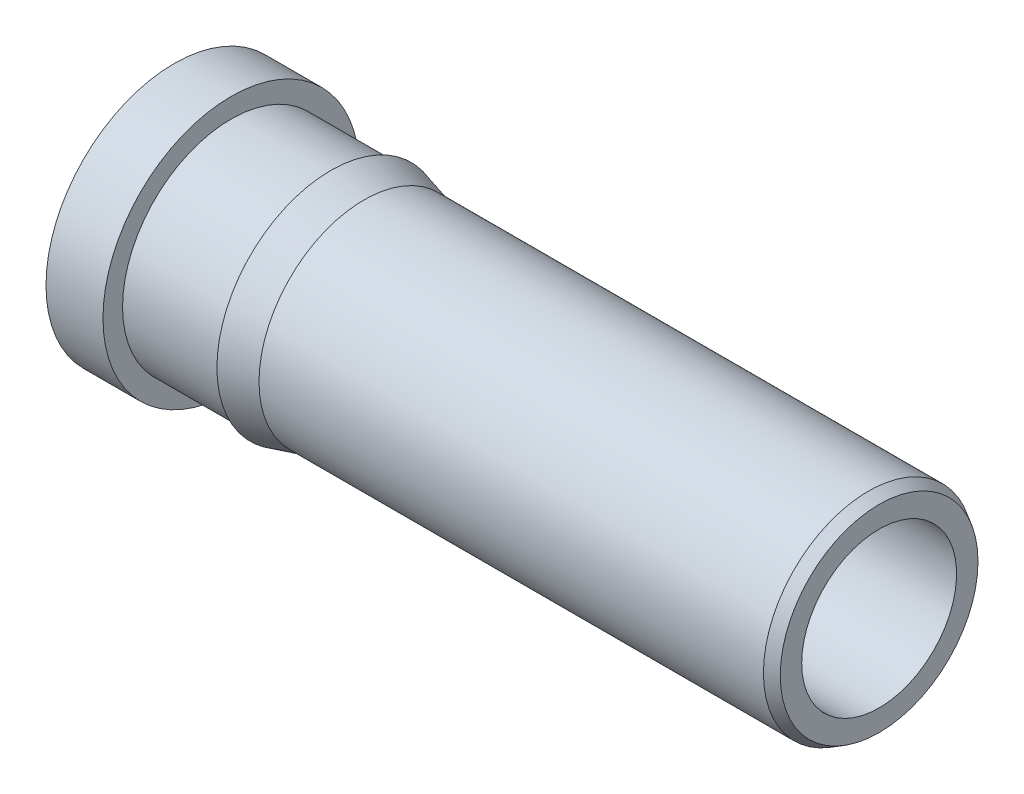
ISO-10303-21;
HEADER;
FILE_DESCRIPTION(('STEP AP214'),'2;1');
FILE_NAME('part.step','',(''),(''),'','','');
FILE_SCHEMA(('AUTOMOTIVE_DESIGN { 1 0 10303 214 1 1 1 1 }'));
ENDSEC;
DATA;
#1=APPLICATION_CONTEXT('core data for automotive mechanical design processes');
#2=APPLICATION_PROTOCOL_DEFINITION('international standard','automotive_design',2000,#1);
#3=PRODUCT_CONTEXT('',#1,'mechanical');
#4=PRODUCT('Part','Part','',(#3));
#5=PRODUCT_RELATED_PRODUCT_CATEGORY('part','',(#4));
#6=PRODUCT_DEFINITION_FORMATION('','',#4);
#7=PRODUCT_DEFINITION_CONTEXT('part definition',#1,'design');
#8=PRODUCT_DEFINITION('design','',#6,#7);
#9=PRODUCT_DEFINITION_SHAPE('','',#8);
#10=(LENGTH_UNIT() NAMED_UNIT(*) SI_UNIT(.MILLI.,.METRE.));
#11=(NAMED_UNIT(*) PLANE_ANGLE_UNIT() SI_UNIT($,.RADIAN.));
#12=(NAMED_UNIT(*) SI_UNIT($,.STERADIAN.) SOLID_ANGLE_UNIT());
#13=UNCERTAINTY_MEASURE_WITH_UNIT(LENGTH_MEASURE(1.E-05),#10,'distance_accuracy_value','');
#14=(GEOMETRIC_REPRESENTATION_CONTEXT(3) GLOBAL_UNCERTAINTY_ASSIGNED_CONTEXT((#13)) GLOBAL_UNIT_ASSIGNED_CONTEXT((#10,
#11,#12)) REPRESENTATION_CONTEXT('',''));
#15=CARTESIAN_POINT('',(0.,0.,0.));
#16=DIRECTION('',(0.,0.,1.));
#17=DIRECTION('',(1.,0.,0.));
#18=AXIS2_PLACEMENT_3D('',#15,#16,#17);
#19=CARTESIAN_POINT('',(5.02920000000003,0.705305909487725,0.));
#20=DIRECTION('',(-1.,0.,0.));
#21=DIRECTION('',(0.,0.,1.));
#22=AXIS2_PLACEMENT_3D('',#19,#20,#21);
#23=PLANE('',#22);
#24=CARTESIAN_POINT('',(5.02920000000004,0.,0.));
#25=DIRECTION('',(-1.,0.,0.));
#26=DIRECTION('',(0.,0.,1.));
#27=AXIS2_PLACEMENT_3D('',#24,#25,#26);
#28=CIRCLE('',#27,0.552449999999999);
#29=CARTESIAN_POINT('',(5.02920000000004,0.,0.552449999999999));
#30=VERTEX_POINT('',#29);
#31=EDGE_CURVE('E70',#30,#30,#28,.T.);
#32=ORIENTED_EDGE('',*,*,#31,.T.);
#33=EDGE_LOOP('',(#32));
#34=FACE_BOUND('',#33,.T.);
#35=CARTESIAN_POINT('',(5.02920000000001,0.,0.));
#36=DIRECTION('',(-1.,0.,0.));
#37=DIRECTION('',(0.,0.,1.));
#38=AXIS2_PLACEMENT_3D('',#35,#36,#37);
#39=CIRCLE('',#38,0.705305909487725);
#40=CARTESIAN_POINT('',(5.02920000000001,0.,0.705305909487725));
#41=VERTEX_POINT('',#40);
#42=EDGE_CURVE('E10',#41,#41,#39,.T.);
#43=ORIENTED_EDGE('',*,*,#42,.F.);
#44=EDGE_LOOP('',(#43));
#45=FACE_BOUND('',#44,.T.);
#46=ADVANCED_FACE('F33',(#34,#45),#23,.F.);
#47=CARTESIAN_POINT('',(5.02920000000001,0.,0.));
#48=DIRECTION('',(-1.,0.,0.));
#49=DIRECTION('',(0.,0.,1.));
#50=AXIS2_PLACEMENT_3D('',#47,#48,#49);
#51=CONICAL_SURFACE('',#50,0.705305909487725,0.523598775598529);
#52=CARTESIAN_POINT('',(4.95300000000004,0.,0.));
#53=DIRECTION('',(-1.,0.,0.));
#54=DIRECTION('',(0.,0.,1.));
#55=AXIS2_PLACEMENT_3D('',#52,#53,#54);
#56=CIRCLE('',#55,0.749299999999981);
#57=CARTESIAN_POINT('',(4.95300000000004,0.,0.749299999999981));
#58=VERTEX_POINT('',#57);
#59=EDGE_CURVE('E40',#58,#58,#56,.T.);
#60=ORIENTED_EDGE('',*,*,#59,.F.);
#61=EDGE_LOOP('',(#60));
#62=FACE_BOUND('',#61,.T.);
#63=ORIENTED_EDGE('',*,*,#42,.T.);
#64=EDGE_LOOP('',(#63));
#65=FACE_BOUND('',#64,.T.);
#66=ADVANCED_FACE('F91',(#62,#65),#51,.T.);
#67=CARTESIAN_POINT('',(0.,0.,0.));
#68=DIRECTION('',(-1.,0.,0.));
#69=DIRECTION('',(0.,0.,1.));
#70=AXIS2_PLACEMENT_3D('',#67,#68,#69);
#71=CYLINDRICAL_SURFACE('',#70,0.749299999999981);
#72=CARTESIAN_POINT('',(1.35458522628059,0.,0.));
#73=DIRECTION('',(-1.,0.,0.));
#74=DIRECTION('',(0.,0.,1.));
#75=AXIS2_PLACEMENT_3D('',#72,#73,#74);
#76=CIRCLE('',#75,0.749299999999981);
#77=CARTESIAN_POINT('',(1.35458522628059,0.,0.749299999999981));
#78=VERTEX_POINT('',#77);
#79=EDGE_CURVE('E44',#78,#78,#76,.T.);
#80=ORIENTED_EDGE('',*,*,#79,.F.);
#81=EDGE_LOOP('',(#80));
#82=FACE_BOUND('',#81,.T.);
#83=ORIENTED_EDGE('',*,*,#59,.T.);
#84=EDGE_LOOP('',(#83));
#85=FACE_BOUND('',#84,.T.);
#86=ADVANCED_FACE('F95',(#82,#85),#71,.T.);
#87=CARTESIAN_POINT('',(1.35458522628059,0.,0.));
#88=DIRECTION('',(-1.,0.,0.));
#89=DIRECTION('',(0.,0.,1.));
#90=AXIS2_PLACEMENT_3D('',#87,#88,#89);
#91=CONICAL_SURFACE('',#90,0.749299999999981,0.261799387799376);
#92=CARTESIAN_POINT('',(1.1176,0.,0.));
#93=DIRECTION('',(-1.,0.,0.));
#94=DIRECTION('',(0.,0.,1.));
#95=AXIS2_PLACEMENT_3D('',#92,#93,#94);
#96=CIRCLE('',#95,0.81280000000003);
#97=CARTESIAN_POINT('',(1.1176,0.,0.81280000000003));
#98=VERTEX_POINT('',#97);
#99=EDGE_CURVE('E49',#98,#98,#96,.T.);
#100=ORIENTED_EDGE('',*,*,#99,.F.);
#101=EDGE_LOOP('',(#100));
#102=FACE_BOUND('',#101,.T.);
#103=ORIENTED_EDGE('',*,*,#79,.T.);
#104=EDGE_LOOP('',(#103));
#105=FACE_BOUND('',#104,.T.);
#106=ADVANCED_FACE('F101',(#102,#105),#91,.T.);
#107=CARTESIAN_POINT('',(1.1176,0.774699999999989,0.));
#108=DIRECTION('',(1.,0.,0.));
#109=DIRECTION('',(0.,0.,-1.));
#110=AXIS2_PLACEMENT_3D('',#107,#108,#109);
#111=PLANE('',#110);
#112=CARTESIAN_POINT('',(1.1176,0.,0.));
#113=DIRECTION('',(-1.,0.,0.));
#114=DIRECTION('',(0.,0.,1.));
#115=AXIS2_PLACEMENT_3D('',#112,#113,#114);
#116=CIRCLE('',#115,0.774699999999989);
#117=CARTESIAN_POINT('',(1.1176,0.,0.774699999999989));
#118=VERTEX_POINT('',#117);
#119=EDGE_CURVE('E52',#118,#118,#116,.T.);
#120=ORIENTED_EDGE('',*,*,#119,.F.);
#121=EDGE_LOOP('',(#120));
#122=FACE_BOUND('',#121,.T.);
#123=ORIENTED_EDGE('',*,*,#99,.T.);
#124=EDGE_LOOP('',(#123));
#125=FACE_BOUND('',#124,.T.);
#126=ADVANCED_FACE('F108',(#122,#125),#111,.F.);
#127=CARTESIAN_POINT('',(0.,0.,0.));
#128=DIRECTION('',(-1.,0.,0.));
#129=DIRECTION('',(0.,0.,1.));
#130=AXIS2_PLACEMENT_3D('',#127,#128,#129);
#131=CYLINDRICAL_SURFACE('',#130,0.774699999999989);
#132=CARTESIAN_POINT('',(0.406400000000029,0.,0.));
#133=DIRECTION('',(-1.,0.,0.));
#134=DIRECTION('',(0.,0.,1.));
#135=AXIS2_PLACEMENT_3D('',#132,#133,#134);
#136=CIRCLE('',#135,0.774699999999989);
#137=CARTESIAN_POINT('',(0.406400000000029,0.,0.774699999999989));
#138=VERTEX_POINT('',#137);
#139=EDGE_CURVE('E55',#138,#138,#136,.T.);
#140=ORIENTED_EDGE('',*,*,#139,.F.);
#141=EDGE_LOOP('',(#140));
#142=FACE_BOUND('',#141,.T.);
#143=ORIENTED_EDGE('',*,*,#119,.T.);
#144=EDGE_LOOP('',(#143));
#145=FACE_BOUND('',#144,.T.);
#146=ADVANCED_FACE('F112',(#142,#145),#131,.T.);
#147=CARTESIAN_POINT('',(0.406400000000015,0.9144,0.));
#148=DIRECTION('',(-1.,0.,0.));
#149=DIRECTION('',(0.,0.,1.));
#150=AXIS2_PLACEMENT_3D('',#147,#148,#149);
#151=PLANE('',#150);
#152=CARTESIAN_POINT('',(0.406400000000001,0.,0.));
#153=DIRECTION('',(-1.,0.,0.));
#154=DIRECTION('',(0.,0.,1.));
#155=AXIS2_PLACEMENT_3D('',#152,#153,#154);
#156=CIRCLE('',#155,0.9144);
#157=CARTESIAN_POINT('',(0.406400000000001,0.,0.9144));
#158=VERTEX_POINT('',#157);
#159=EDGE_CURVE('E58',#158,#158,#156,.T.);
#160=ORIENTED_EDGE('',*,*,#159,.F.);
#161=EDGE_LOOP('',(#160));
#162=FACE_BOUND('',#161,.T.);
#163=ORIENTED_EDGE('',*,*,#139,.T.);
#164=EDGE_LOOP('',(#163));
#165=FACE_BOUND('',#164,.T.);
#166=ADVANCED_FACE('F116',(#162,#165),#151,.F.);
#167=CARTESIAN_POINT('',(0.,0.,0.));
#168=DIRECTION('',(-1.,0.,0.));
#169=DIRECTION('',(0.,0.,1.));
#170=AXIS2_PLACEMENT_3D('',#167,#168,#169);
#171=CYLINDRICAL_SURFACE('',#170,0.9144);
#172=CARTESIAN_POINT('',(0.,0.,0.));
#173=DIRECTION('',(-1.,0.,0.));
#174=DIRECTION('',(0.,0.,1.));
#175=AXIS2_PLACEMENT_3D('',#172,#173,#174);
#176=CIRCLE('',#175,0.9144);
#177=CARTESIAN_POINT('',(0.,0.,0.9144));
#178=VERTEX_POINT('',#177);
#179=EDGE_CURVE('E61',#178,#178,#176,.T.);
#180=ORIENTED_EDGE('',*,*,#179,.F.);
#181=EDGE_LOOP('',(#180));
#182=FACE_BOUND('',#181,.T.);
#183=ORIENTED_EDGE('',*,*,#159,.T.);
#184=EDGE_LOOP('',(#183));
#185=FACE_BOUND('',#184,.T.);
#186=ADVANCED_FACE('F120',(#182,#185),#171,.T.);
#187=CARTESIAN_POINT('',(0.,0.,0.));
#188=DIRECTION('',(1.,0.,0.));
#189=DIRECTION('',(0.,0.,-1.));
#190=AXIS2_PLACEMENT_3D('',#187,#188,#189);
#191=PLANE('',#190);
#192=CARTESIAN_POINT('',(0.,0.,0.));
#193=DIRECTION('',(-1.,0.,0.));
#194=DIRECTION('',(0.,0.,1.));
#195=AXIS2_PLACEMENT_3D('',#192,#193,#194);
#196=CIRCLE('',#195,0.647699999999999);
#197=CARTESIAN_POINT('',(0.,0.,0.647699999999999));
#198=VERTEX_POINT('',#197);
#199=EDGE_CURVE('E67',#198,#198,#196,.T.);
#200=ORIENTED_EDGE('',*,*,#199,.F.);
#201=EDGE_LOOP('',(#200));
#202=FACE_BOUND('',#201,.T.);
#203=ORIENTED_EDGE('',*,*,#179,.T.);
#204=EDGE_LOOP('',(#203));
#205=FACE_BOUND('',#204,.T.);
#206=ADVANCED_FACE('F124',(#202,#205),#191,.F.);
#207=CARTESIAN_POINT('',(2.3368,0.,0.));
#208=DIRECTION('',(-1.,0.,0.));
#209=DIRECTION('',(0.,0.,1.));
#210=AXIS2_PLACEMENT_3D('',#207,#208,#209);
#211=CONICAL_SURFACE('',#210,0.647699999999999,1.02974425867666);
#212=CARTESIAN_POINT('',(2.39403197396237,0.,0.));
#213=DIRECTION('',(-1.,0.,0.));
#214=DIRECTION('',(0.,0.,1.));
#215=AXIS2_PLACEMENT_3D('',#212,#213,#214);
#216=CIRCLE('',#215,0.552449999999999);
#217=CARTESIAN_POINT('',(2.39403197396237,0.,0.552449999999999));
#218=VERTEX_POINT('',#217);
#219=EDGE_CURVE('E36',#218,#218,#216,.F.);
#220=ORIENTED_EDGE('',*,*,#219,.T.);
#221=EDGE_LOOP('',(#220));
#222=FACE_BOUND('',#221,.T.);
#223=CARTESIAN_POINT('',(2.3368,0.,0.));
#224=DIRECTION('',(-1.,0.,0.));
#225=DIRECTION('',(0.,0.,1.));
#226=AXIS2_PLACEMENT_3D('',#223,#224,#225);
#227=CIRCLE('',#226,0.647699999999999);
#228=CARTESIAN_POINT('',(2.3368,0.,0.647699999999999));
#229=VERTEX_POINT('',#228);
#230=EDGE_CURVE('E64',#229,#229,#227,.T.);
#231=ORIENTED_EDGE('',*,*,#230,.T.);
#232=EDGE_LOOP('',(#231));
#233=FACE_BOUND('',#232,.T.);
#234=ADVANCED_FACE('F77',(#222,#233),#211,.F.);
#235=CARTESIAN_POINT('',(0.,0.,0.));
#236=DIRECTION('',(-1.,0.,0.));
#237=DIRECTION('',(0.,0.,1.));
#238=AXIS2_PLACEMENT_3D('',#235,#236,#237);
#239=CYLINDRICAL_SURFACE('',#238,0.647699999999999);
#240=ORIENTED_EDGE('',*,*,#230,.F.);
#241=EDGE_LOOP('',(#240));
#242=FACE_BOUND('',#241,.T.);
#243=ORIENTED_EDGE('',*,*,#199,.T.);
#244=EDGE_LOOP('',(#243));
#245=FACE_BOUND('',#244,.T.);
#246=ADVANCED_FACE('F82',(#242,#245),#239,.F.);
#247=CARTESIAN_POINT('',(0.,0.,0.));
#248=DIRECTION('',(-1.,0.,0.));
#249=DIRECTION('',(0.,0.,1.));
#250=AXIS2_PLACEMENT_3D('',#247,#248,#249);
#251=CYLINDRICAL_SURFACE('',#250,0.552449999999999);
#252=ORIENTED_EDGE('',*,*,#31,.F.);
#253=EDGE_LOOP('',(#252));
#254=FACE_BOUND('',#253,.T.);
#255=ORIENTED_EDGE('',*,*,#219,.F.);
#256=EDGE_LOOP('',(#255));
#257=FACE_BOUND('',#256,.T.);
#258=ADVANCED_FACE('F80',(#254,#257),#251,.F.);
#259=CLOSED_SHELL('',(#46,#66,#86,#106,#126,#146,#166,#186,#206,#234,#246,#258));
#260=MANIFOLD_SOLID_BREP('B2',#259);
#261=ADVANCED_BREP_SHAPE_REPRESENTATION('',(#18,#260),#14);
#262=SHAPE_DEFINITION_REPRESENTATION(#9,#261);
ENDSEC;
END-ISO-10303-21;
